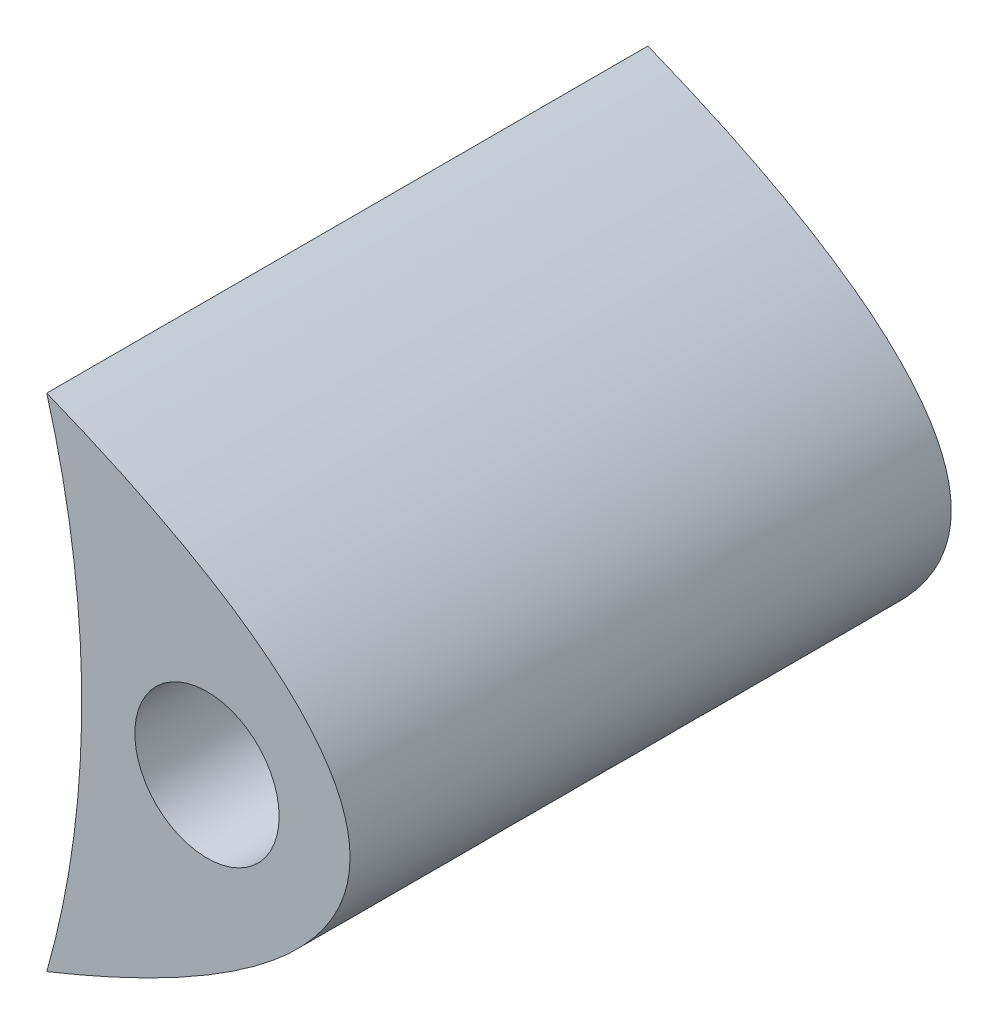
ISO-10303-21;
HEADER;
FILE_DESCRIPTION(('STEP AP214'),'2;1');
FILE_NAME('part.step','',(''),(''),'','','');
FILE_SCHEMA(('AUTOMOTIVE_DESIGN { 1 0 10303 214 1 1 1 1 }'));
ENDSEC;
DATA;
#1=APPLICATION_CONTEXT('core data for automotive mechanical design processes');
#2=APPLICATION_PROTOCOL_DEFINITION('international standard','automotive_design',2000,#1);
#3=PRODUCT_CONTEXT('',#1,'mechanical');
#4=PRODUCT('Part','Part','',(#3));
#5=PRODUCT_RELATED_PRODUCT_CATEGORY('part','',(#4));
#6=PRODUCT_DEFINITION_FORMATION('','',#4);
#7=PRODUCT_DEFINITION_CONTEXT('part definition',#1,'design');
#8=PRODUCT_DEFINITION('design','',#6,#7);
#9=PRODUCT_DEFINITION_SHAPE('','',#8);
#10=(LENGTH_UNIT() NAMED_UNIT(*) SI_UNIT(.MILLI.,.METRE.));
#11=(NAMED_UNIT(*) PLANE_ANGLE_UNIT() SI_UNIT($,.RADIAN.));
#12=(NAMED_UNIT(*) SI_UNIT($,.STERADIAN.) SOLID_ANGLE_UNIT());
#13=UNCERTAINTY_MEASURE_WITH_UNIT(LENGTH_MEASURE(1.E-05),#10,'distance_accuracy_value','');
#14=(GEOMETRIC_REPRESENTATION_CONTEXT(3) GLOBAL_UNCERTAINTY_ASSIGNED_CONTEXT((#13)) GLOBAL_UNIT_ASSIGNED_CONTEXT((#10,
#11,#12)) REPRESENTATION_CONTEXT('',''));
#15=CARTESIAN_POINT('',(0.,0.,0.));
#16=DIRECTION('',(0.,0.,1.));
#17=DIRECTION('',(1.,0.,0.));
#18=AXIS2_PLACEMENT_3D('',#15,#16,#17);
#19=CARTESIAN_POINT('',(-132.695207379591,0.,-15.24));
#20=DIRECTION('',(0.,0.,-1.));
#21=DIRECTION('',(1.,0.,0.));
#22=AXIS2_PLACEMENT_3D('',#19,#20,#21);
#23=ELLIPSE('',#22,136.322217126686,19.1789431834164);
#24=DIRECTION('',(0.,0.,1.));
#25=VECTOR('',#24,1.);
#26=SURFACE_OF_LINEAR_EXTRUSION('',#23,#25);
#27=CARTESIAN_POINT('',(-132.695207379591,0.,0.));
#28=DIRECTION('',(0.,0.,-1.));
#29=DIRECTION('',(1.,0.,0.));
#30=AXIS2_PLACEMENT_3D('',#27,#28,#29);
#31=ELLIPSE('',#30,136.322217126686,19.1789431834164);
#32=CARTESIAN_POINT('',(-4.0617841188993,6.35,0.));
#33=VERTEX_POINT('',#32);
#34=CARTESIAN_POINT('',(-4.0617841188993,-6.35,0.));
#35=VERTEX_POINT('',#34);
#36=EDGE_CURVE('E70',#33,#35,#31,.T.);
#37=ORIENTED_EDGE('',*,*,#36,.T.);
#38=DIRECTION('',(0.,0.,1.));
#39=VECTOR('',#38,1.);
#40=CARTESIAN_POINT('',(-4.0617841188993,-6.35,-15.24));
#41=LINE('',#40,#39);
#42=CARTESIAN_POINT('',(-4.0617841188993,-6.35,-15.24));
#43=VERTEX_POINT('',#42);
#44=EDGE_CURVE('E11',#43,#35,#41,.T.);
#45=ORIENTED_EDGE('',*,*,#44,.F.);
#46=CARTESIAN_POINT('',(-4.0617841188993,6.35,-15.24));
#47=VERTEX_POINT('',#46);
#48=EDGE_CURVE('E54',#47,#43,#23,.T.);
#49=ORIENTED_EDGE('',*,*,#48,.F.);
#50=DIRECTION('',(0.,0.,1.));
#51=VECTOR('',#50,1.);
#52=CARTESIAN_POINT('',(-4.0617841188993,6.35,-15.24));
#53=LINE('',#52,#51);
#54=EDGE_CURVE('E42',#47,#33,#53,.T.);
#55=ORIENTED_EDGE('',*,*,#54,.T.);
#56=EDGE_LOOP('',(#37,#45,#49,#55));
#57=FACE_BOUND('',#56,.T.);
#58=ADVANCED_FACE('F38',(#57),#26,.F.);
#59=CARTESIAN_POINT('',(-26.3536323172756,0.,-15.24));
#60=DIRECTION('',(0.,0.,1.));
#61=DIRECTION('',(1.,0.,0.));
#62=AXIS2_PLACEMENT_3D('',#59,#60,#61);
#63=CYLINDRICAL_SURFACE('',#62,23.1786323172756);
#64=CARTESIAN_POINT('',(-26.3536323172756,0.,0.));
#65=DIRECTION('',(0.,0.,1.));
#66=DIRECTION('',(1.,0.,0.));
#67=AXIS2_PLACEMENT_3D('',#64,#65,#66);
#68=CIRCLE('',#67,23.1786323172756);
#69=EDGE_CURVE('E68',#33,#35,#68,.F.);
#70=ORIENTED_EDGE('',*,*,#69,.F.);
#71=ORIENTED_EDGE('',*,*,#54,.F.);
#72=CARTESIAN_POINT('',(-26.3536323172756,0.,-15.24));
#73=DIRECTION('',(0.,0.,1.));
#74=DIRECTION('',(1.,0.,0.));
#75=AXIS2_PLACEMENT_3D('',#72,#73,#74);
#76=CIRCLE('',#75,23.1786323172756);
#77=EDGE_CURVE('E69',#47,#43,#76,.F.);
#78=ORIENTED_EDGE('',*,*,#77,.T.);
#79=ORIENTED_EDGE('',*,*,#44,.T.);
#80=EDGE_LOOP('',(#70,#71,#78,#79));
#81=FACE_BOUND('',#80,.T.);
#82=ADVANCED_FACE('F66',(#81),#63,.F.);
#83=CARTESIAN_POINT('',(0.,0.,-15.24));
#84=DIRECTION('',(0.,0.,1.));
#85=DIRECTION('',(1.,0.,0.));
#86=AXIS2_PLACEMENT_3D('',#83,#84,#85);
#87=PLANE('',#86);
#88=CARTESIAN_POINT('',(0.,0.,-15.24));
#89=DIRECTION('',(0.,0.,1.));
#90=DIRECTION('',(1.,0.,0.));
#91=AXIS2_PLACEMENT_3D('',#88,#89,#90);
#92=CIRCLE('',#91,1.8288);
#93=CARTESIAN_POINT('',(1.8288,0.,-15.24));
#94=VERTEX_POINT('',#93);
#95=EDGE_CURVE('E72',#94,#94,#92,.T.);
#96=ORIENTED_EDGE('',*,*,#95,.T.);
#97=EDGE_LOOP('',(#96));
#98=FACE_BOUND('',#97,.T.);
#99=ORIENTED_EDGE('',*,*,#48,.T.);
#100=ORIENTED_EDGE('',*,*,#77,.F.);
#101=EDGE_LOOP('',(#99,#100));
#102=FACE_BOUND('',#101,.T.);
#103=ADVANCED_FACE('F88',(#98,#102),#87,.F.);
#104=CARTESIAN_POINT('',(0.,0.,0.));
#105=DIRECTION('',(0.,0.,1.));
#106=DIRECTION('',(1.,0.,0.));
#107=AXIS2_PLACEMENT_3D('',#104,#105,#106);
#108=PLANE('',#107);
#109=CARTESIAN_POINT('',(0.,0.,0.));
#110=DIRECTION('',(0.,0.,1.));
#111=DIRECTION('',(1.,0.,0.));
#112=AXIS2_PLACEMENT_3D('',#109,#110,#111);
#113=CIRCLE('',#112,1.8288);
#114=CARTESIAN_POINT('',(1.8288,0.,0.));
#115=VERTEX_POINT('',#114);
#116=EDGE_CURVE('E81',#115,#115,#113,.T.);
#117=ORIENTED_EDGE('',*,*,#116,.F.);
#118=EDGE_LOOP('',(#117));
#119=FACE_BOUND('',#118,.T.);
#120=ORIENTED_EDGE('',*,*,#36,.F.);
#121=ORIENTED_EDGE('',*,*,#69,.T.);
#122=EDGE_LOOP('',(#120,#121));
#123=FACE_BOUND('',#122,.T.);
#124=ADVANCED_FACE('F74',(#119,#123),#108,.T.);
#125=CARTESIAN_POINT('',(0.,0.,0.));
#126=DIRECTION('',(0.,0.,1.));
#127=DIRECTION('',(1.,0.,0.));
#128=AXIS2_PLACEMENT_3D('',#125,#126,#127);
#129=CYLINDRICAL_SURFACE('',#128,1.8288);
#130=ORIENTED_EDGE('',*,*,#95,.F.);
#131=EDGE_LOOP('',(#130));
#132=FACE_BOUND('',#131,.T.);
#133=ORIENTED_EDGE('',*,*,#116,.T.);
#134=EDGE_LOOP('',(#133));
#135=FACE_BOUND('',#134,.T.);
#136=ADVANCED_FACE('F85',(#132,#135),#129,.F.);
#137=CLOSED_SHELL('',(#58,#82,#103,#124,#136));
#138=MANIFOLD_SOLID_BREP('B2',#137);
#139=ADVANCED_BREP_SHAPE_REPRESENTATION('',(#18,#138),#14);
#140=SHAPE_DEFINITION_REPRESENTATION(#9,#139);
ENDSEC;
END-ISO-10303-21;
